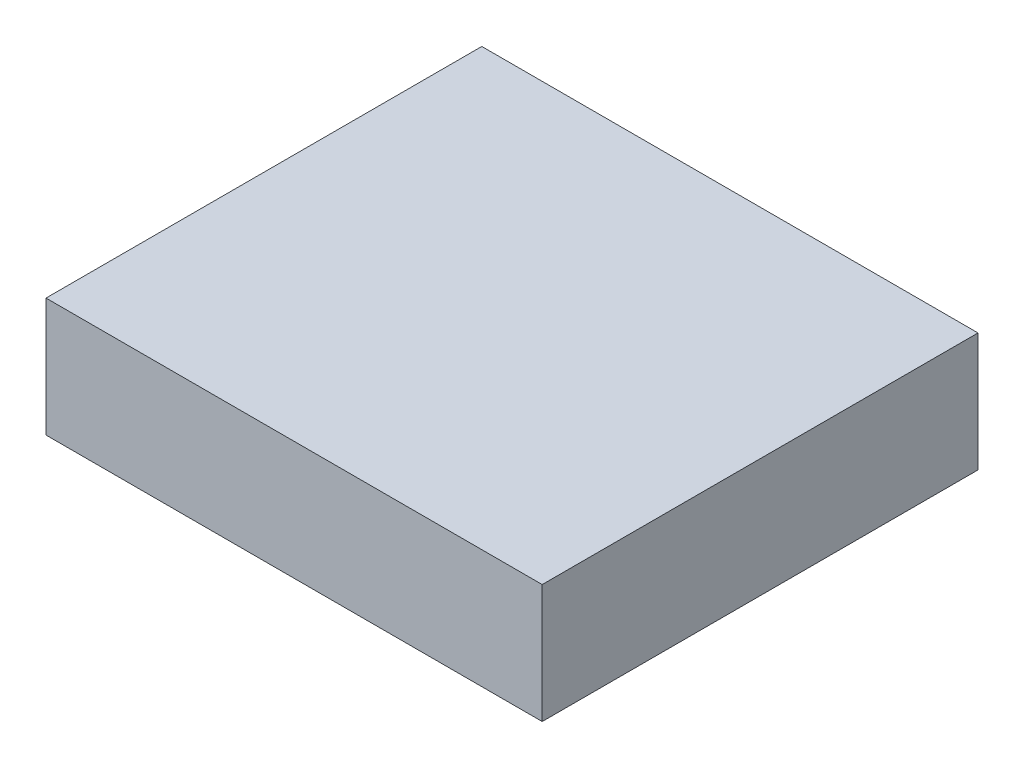
ISO-10303-21;
HEADER;
FILE_DESCRIPTION(('STEP AP214'),'2;1');
FILE_NAME('part.step','',(''),(''),'','','');
FILE_SCHEMA(('AUTOMOTIVE_DESIGN { 1 0 10303 214 1 1 1 1 }'));
ENDSEC;
DATA;
#1=APPLICATION_CONTEXT('core data for automotive mechanical design processes');
#2=APPLICATION_PROTOCOL_DEFINITION('international standard','automotive_design',2000,#1);
#3=PRODUCT_CONTEXT('',#1,'mechanical');
#4=PRODUCT('Part','Part','',(#3));
#5=PRODUCT_RELATED_PRODUCT_CATEGORY('part','',(#4));
#6=PRODUCT_DEFINITION_FORMATION('','',#4);
#7=PRODUCT_DEFINITION_CONTEXT('part definition',#1,'design');
#8=PRODUCT_DEFINITION('design','',#6,#7);
#9=PRODUCT_DEFINITION_SHAPE('','',#8);
#10=(LENGTH_UNIT() NAMED_UNIT(*) SI_UNIT(.MILLI.,.METRE.));
#11=(NAMED_UNIT(*) PLANE_ANGLE_UNIT() SI_UNIT($,.RADIAN.));
#12=(NAMED_UNIT(*) SI_UNIT($,.STERADIAN.) SOLID_ANGLE_UNIT());
#13=UNCERTAINTY_MEASURE_WITH_UNIT(LENGTH_MEASURE(1.E-05),#10,'distance_accuracy_value','');
#14=(GEOMETRIC_REPRESENTATION_CONTEXT(3) GLOBAL_UNCERTAINTY_ASSIGNED_CONTEXT((#13)) GLOBAL_UNIT_ASSIGNED_CONTEXT((#10,
#11,#12)) REPRESENTATION_CONTEXT('',''));
#15=CARTESIAN_POINT('',(0.,0.,0.));
#16=DIRECTION('',(0.,0.,1.));
#17=DIRECTION('',(1.,0.,0.));
#18=AXIS2_PLACEMENT_3D('',#15,#16,#17);
#19=CARTESIAN_POINT('',(57.5,27.5,50.5));
#20=DIRECTION('',(-1.,0.,0.));
#21=DIRECTION('',(0.,0.,1.));
#22=AXIS2_PLACEMENT_3D('',#19,#20,#21);
#23=PLANE('',#22);
#24=DIRECTION('',(0.,0.,-1.));
#25=VECTOR('',#24,1.);
#26=CARTESIAN_POINT('',(57.5,0.,50.5));
#27=LINE('',#26,#25);
#28=CARTESIAN_POINT('',(57.5,0.,50.5));
#29=VERTEX_POINT('',#28);
#30=CARTESIAN_POINT('',(57.5,0.,-50.5));
#31=VERTEX_POINT('',#30);
#32=EDGE_CURVE('E95',#29,#31,#27,.T.);
#33=ORIENTED_EDGE('',*,*,#32,.T.);
#34=DIRECTION('',(0.,-1.,0.));
#35=VECTOR('',#34,1.);
#36=CARTESIAN_POINT('',(57.5,27.5,-50.5));
#37=LINE('',#36,#35);
#38=CARTESIAN_POINT('',(57.5,27.5,-50.5));
#39=VERTEX_POINT('',#38);
#40=EDGE_CURVE('E11',#39,#31,#37,.T.);
#41=ORIENTED_EDGE('',*,*,#40,.F.);
#42=DIRECTION('',(0.,0.,-1.));
#43=VECTOR('',#42,1.);
#44=CARTESIAN_POINT('',(57.5,27.5,50.5));
#45=LINE('',#44,#43);
#46=CARTESIAN_POINT('',(57.5,27.5,50.5));
#47=VERTEX_POINT('',#46);
#48=EDGE_CURVE('E83',#47,#39,#45,.T.);
#49=ORIENTED_EDGE('',*,*,#48,.F.);
#50=DIRECTION('',(0.,-1.,0.));
#51=VECTOR('',#50,1.);
#52=CARTESIAN_POINT('',(57.5,27.5,50.5));
#53=LINE('',#52,#51);
#54=EDGE_CURVE('E91',#47,#29,#53,.T.);
#55=ORIENTED_EDGE('',*,*,#54,.T.);
#56=EDGE_LOOP('',(#33,#41,#49,#55));
#57=FACE_BOUND('',#56,.T.);
#58=ADVANCED_FACE('F32',(#57),#23,.F.);
#59=CARTESIAN_POINT('',(-57.5,27.5,-50.5));
#60=DIRECTION('',(0.,0.,1.));
#61=DIRECTION('',(1.,0.,0.));
#62=AXIS2_PLACEMENT_3D('',#59,#60,#61);
#63=PLANE('',#62);
#64=DIRECTION('',(-1.,0.,0.));
#65=VECTOR('',#64,1.);
#66=CARTESIAN_POINT('',(-57.5,0.,-50.5));
#67=LINE('',#66,#65);
#68=CARTESIAN_POINT('',(-57.5,0.,-50.5));
#69=VERTEX_POINT('',#68);
#70=EDGE_CURVE('E87',#31,#69,#67,.T.);
#71=ORIENTED_EDGE('',*,*,#70,.T.);
#72=DIRECTION('',(0.,-1.,0.));
#73=VECTOR('',#72,1.);
#74=CARTESIAN_POINT('',(-57.5,27.5,-50.5));
#75=LINE('',#74,#73);
#76=CARTESIAN_POINT('',(-57.5,27.5,-50.5));
#77=VERTEX_POINT('',#76);
#78=EDGE_CURVE('E40',#77,#69,#75,.T.);
#79=ORIENTED_EDGE('',*,*,#78,.F.);
#80=DIRECTION('',(-1.,0.,0.));
#81=VECTOR('',#80,1.);
#82=CARTESIAN_POINT('',(-57.5,27.5,-50.5));
#83=LINE('',#82,#81);
#84=EDGE_CURVE('E78',#39,#77,#83,.T.);
#85=ORIENTED_EDGE('',*,*,#84,.F.);
#86=ORIENTED_EDGE('',*,*,#40,.T.);
#87=EDGE_LOOP('',(#71,#79,#85,#86));
#88=FACE_BOUND('',#87,.T.);
#89=ADVANCED_FACE('F86',(#88),#63,.F.);
#90=CARTESIAN_POINT('',(-57.5,27.5,50.5));
#91=DIRECTION('',(1.,0.,0.));
#92=DIRECTION('',(0.,0.,-1.));
#93=AXIS2_PLACEMENT_3D('',#90,#91,#92);
#94=PLANE('',#93);
#95=DIRECTION('',(0.,0.,1.));
#96=VECTOR('',#95,1.);
#97=CARTESIAN_POINT('',(-57.5,0.,50.5));
#98=LINE('',#97,#96);
#99=CARTESIAN_POINT('',(-57.5,0.,50.5));
#100=VERTEX_POINT('',#99);
#101=EDGE_CURVE('E65',#69,#100,#98,.T.);
#102=ORIENTED_EDGE('',*,*,#101,.T.);
#103=DIRECTION('',(0.,-1.,0.));
#104=VECTOR('',#103,1.);
#105=CARTESIAN_POINT('',(-57.5,27.5,50.5));
#106=LINE('',#105,#104);
#107=CARTESIAN_POINT('',(-57.5,27.5,50.5));
#108=VERTEX_POINT('',#107);
#109=EDGE_CURVE('E88',#108,#100,#106,.T.);
#110=ORIENTED_EDGE('',*,*,#109,.F.);
#111=DIRECTION('',(0.,0.,1.));
#112=VECTOR('',#111,1.);
#113=CARTESIAN_POINT('',(-57.5,27.5,50.5));
#114=LINE('',#113,#112);
#115=EDGE_CURVE('E81',#77,#108,#114,.T.);
#116=ORIENTED_EDGE('',*,*,#115,.F.);
#117=ORIENTED_EDGE('',*,*,#78,.T.);
#118=EDGE_LOOP('',(#102,#110,#116,#117));
#119=FACE_BOUND('',#118,.T.);
#120=ADVANCED_FACE('F89',(#119),#94,.F.);
#121=CARTESIAN_POINT('',(-57.5,27.5,50.5));
#122=DIRECTION('',(0.,0.,-1.));
#123=DIRECTION('',(-1.,0.,0.));
#124=AXIS2_PLACEMENT_3D('',#121,#122,#123);
#125=PLANE('',#124);
#126=DIRECTION('',(1.,0.,0.));
#127=VECTOR('',#126,1.);
#128=CARTESIAN_POINT('',(-57.5,0.,50.5));
#129=LINE('',#128,#127);
#130=EDGE_CURVE('E71',#100,#29,#129,.T.);
#131=ORIENTED_EDGE('',*,*,#130,.T.);
#132=ORIENTED_EDGE('',*,*,#54,.F.);
#133=DIRECTION('',(1.,0.,0.));
#134=VECTOR('',#133,1.);
#135=CARTESIAN_POINT('',(-57.5,27.5,50.5));
#136=LINE('',#135,#134);
#137=EDGE_CURVE('E48',#108,#47,#136,.T.);
#138=ORIENTED_EDGE('',*,*,#137,.F.);
#139=ORIENTED_EDGE('',*,*,#109,.T.);
#140=EDGE_LOOP('',(#131,#132,#138,#139));
#141=FACE_BOUND('',#140,.T.);
#142=ADVANCED_FACE('F102',(#141),#125,.F.);
#143=CARTESIAN_POINT('',(0.,27.5,0.));
#144=DIRECTION('',(0.,-1.,0.));
#145=DIRECTION('',(0.,0.,-1.));
#146=AXIS2_PLACEMENT_3D('',#143,#144,#145);
#147=PLANE('',#146);
#148=ORIENTED_EDGE('',*,*,#48,.T.);
#149=ORIENTED_EDGE('',*,*,#84,.T.);
#150=ORIENTED_EDGE('',*,*,#115,.T.);
#151=ORIENTED_EDGE('',*,*,#137,.T.);
#152=EDGE_LOOP('',(#148,#149,#150,#151));
#153=FACE_BOUND('',#152,.T.);
#154=ADVANCED_FACE('F79',(#153),#147,.F.);
#155=CARTESIAN_POINT('',(0.,0.,0.));
#156=DIRECTION('',(0.,-1.,0.));
#157=DIRECTION('',(0.,0.,-1.));
#158=AXIS2_PLACEMENT_3D('',#155,#156,#157);
#159=PLANE('',#158);
#160=ORIENTED_EDGE('',*,*,#32,.F.);
#161=ORIENTED_EDGE('',*,*,#130,.F.);
#162=ORIENTED_EDGE('',*,*,#101,.F.);
#163=ORIENTED_EDGE('',*,*,#70,.F.);
#164=EDGE_LOOP('',(#160,#161,#162,#163));
#165=FACE_BOUND('',#164,.T.);
#166=ADVANCED_FACE('F105',(#165),#159,.T.);
#167=CLOSED_SHELL('',(#58,#89,#120,#142,#154,#166));
#168=MANIFOLD_SOLID_BREP('B2',#167);
#169=ADVANCED_BREP_SHAPE_REPRESENTATION('',(#18,#168),#14);
#170=SHAPE_DEFINITION_REPRESENTATION(#9,#169);
ENDSEC;
END-ISO-10303-21;
